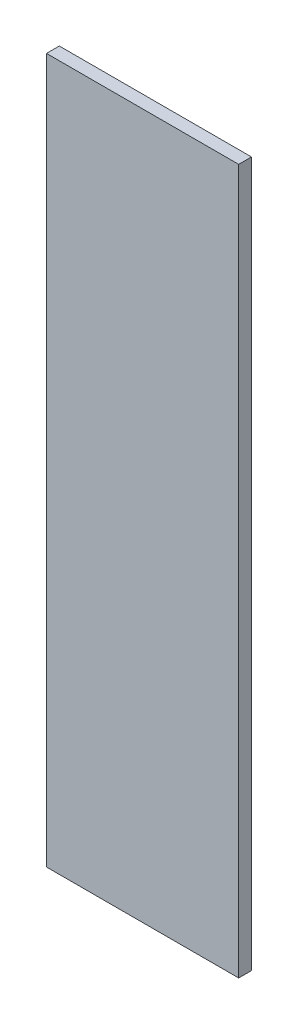
ISO-10303-21;
HEADER;
FILE_DESCRIPTION(('STEP AP214'),'2;1');
FILE_NAME('part.step','',(''),(''),'','','');
FILE_SCHEMA(('AUTOMOTIVE_DESIGN { 1 0 10303 214 1 1 1 1 }'));
ENDSEC;
DATA;
#1=APPLICATION_CONTEXT('core data for automotive mechanical design processes');
#2=APPLICATION_PROTOCOL_DEFINITION('international standard','automotive_design',2000,#1);
#3=PRODUCT_CONTEXT('',#1,'mechanical');
#4=PRODUCT('Part','Part','',(#3));
#5=PRODUCT_RELATED_PRODUCT_CATEGORY('part','',(#4));
#6=PRODUCT_DEFINITION_FORMATION('','',#4);
#7=PRODUCT_DEFINITION_CONTEXT('part definition',#1,'design');
#8=PRODUCT_DEFINITION('design','',#6,#7);
#9=PRODUCT_DEFINITION_SHAPE('','',#8);
#10=(LENGTH_UNIT() NAMED_UNIT(*) SI_UNIT(.MILLI.,.METRE.));
#11=(NAMED_UNIT(*) PLANE_ANGLE_UNIT() SI_UNIT($,.RADIAN.));
#12=(NAMED_UNIT(*) SI_UNIT($,.STERADIAN.) SOLID_ANGLE_UNIT());
#13=UNCERTAINTY_MEASURE_WITH_UNIT(LENGTH_MEASURE(1.E-05),#10,'distance_accuracy_value','');
#14=(GEOMETRIC_REPRESENTATION_CONTEXT(3) GLOBAL_UNCERTAINTY_ASSIGNED_CONTEXT((#13)) GLOBAL_UNIT_ASSIGNED_CONTEXT((#10,
#11,#12)) REPRESENTATION_CONTEXT('',''));
#15=CARTESIAN_POINT('',(0.,0.,0.));
#16=DIRECTION('',(0.,0.,1.));
#17=DIRECTION('',(1.,0.,0.));
#18=AXIS2_PLACEMENT_3D('',#15,#16,#17);
#19=CARTESIAN_POINT('',(-11.2355212355212,17.4324324324324,2.));
#20=DIRECTION('',(1.,0.,0.));
#21=DIRECTION('',(0.,1.,0.));
#22=AXIS2_PLACEMENT_3D('',#19,#20,#21);
#23=PLANE('',#22);
#24=DIRECTION('',(0.,-1.,0.));
#25=VECTOR('',#24,1.);
#26=CARTESIAN_POINT('',(-11.2355212355212,17.4324324324324,0.));
#27=LINE('',#26,#25);
#28=CARTESIAN_POINT('',(-11.2355212355212,17.4324324324324,0.));
#29=VERTEX_POINT('',#28);
#30=CARTESIAN_POINT('',(-11.2355212355212,-92.5675675675676,0.));
#31=VERTEX_POINT('',#30);
#32=EDGE_CURVE('E98',#29,#31,#27,.T.);
#33=ORIENTED_EDGE('',*,*,#32,.T.);
#34=DIRECTION('',(0.,0.,-1.));
#35=VECTOR('',#34,1.);
#36=CARTESIAN_POINT('',(-11.2355212355212,-92.5675675675676,2.));
#37=LINE('',#36,#35);
#38=CARTESIAN_POINT('',(-11.2355212355212,-92.5675675675676,2.));
#39=VERTEX_POINT('',#38);
#40=EDGE_CURVE('E11',#39,#31,#37,.T.);
#41=ORIENTED_EDGE('',*,*,#40,.F.);
#42=DIRECTION('',(0.,-1.,0.));
#43=VECTOR('',#42,1.);
#44=CARTESIAN_POINT('',(-11.2355212355212,17.4324324324324,2.));
#45=LINE('',#44,#43);
#46=CARTESIAN_POINT('',(-11.2355212355212,17.4324324324324,2.));
#47=VERTEX_POINT('',#46);
#48=EDGE_CURVE('E86',#47,#39,#45,.T.);
#49=ORIENTED_EDGE('',*,*,#48,.F.);
#50=DIRECTION('',(0.,0.,-1.));
#51=VECTOR('',#50,1.);
#52=CARTESIAN_POINT('',(-11.2355212355212,17.4324324324324,2.));
#53=LINE('',#52,#51);
#54=EDGE_CURVE('E94',#47,#29,#53,.T.);
#55=ORIENTED_EDGE('',*,*,#54,.T.);
#56=EDGE_LOOP('',(#33,#41,#49,#55));
#57=FACE_BOUND('',#56,.T.);
#58=ADVANCED_FACE('F35',(#57),#23,.F.);
#59=CARTESIAN_POINT('',(-11.2355212355212,-92.5675675675676,2.));
#60=DIRECTION('',(0.,1.,0.));
#61=DIRECTION('',(0.,0.,1.));
#62=AXIS2_PLACEMENT_3D('',#59,#60,#61);
#63=PLANE('',#62);
#64=DIRECTION('',(1.,0.,0.));
#65=VECTOR('',#64,1.);
#66=CARTESIAN_POINT('',(-11.2355212355212,-92.5675675675676,0.));
#67=LINE('',#66,#65);
#68=CARTESIAN_POINT('',(18.7644787644788,-92.5675675675676,0.));
#69=VERTEX_POINT('',#68);
#70=EDGE_CURVE('E90',#31,#69,#67,.T.);
#71=ORIENTED_EDGE('',*,*,#70,.T.);
#72=DIRECTION('',(0.,0.,-1.));
#73=VECTOR('',#72,1.);
#74=CARTESIAN_POINT('',(18.7644787644788,-92.5675675675676,2.));
#75=LINE('',#74,#73);
#76=CARTESIAN_POINT('',(18.7644787644788,-92.5675675675676,2.));
#77=VERTEX_POINT('',#76);
#78=EDGE_CURVE('E43',#77,#69,#75,.T.);
#79=ORIENTED_EDGE('',*,*,#78,.F.);
#80=DIRECTION('',(1.,0.,0.));
#81=VECTOR('',#80,1.);
#82=CARTESIAN_POINT('',(-11.2355212355212,-92.5675675675676,2.));
#83=LINE('',#82,#81);
#84=EDGE_CURVE('E81',#39,#77,#83,.T.);
#85=ORIENTED_EDGE('',*,*,#84,.F.);
#86=ORIENTED_EDGE('',*,*,#40,.T.);
#87=EDGE_LOOP('',(#71,#79,#85,#86));
#88=FACE_BOUND('',#87,.T.);
#89=ADVANCED_FACE('F89',(#88),#63,.F.);
#90=CARTESIAN_POINT('',(18.7644787644788,17.4324324324324,2.));
#91=DIRECTION('',(-1.,0.,0.));
#92=DIRECTION('',(0.,-1.,0.));
#93=AXIS2_PLACEMENT_3D('',#90,#91,#92);
#94=PLANE('',#93);
#95=DIRECTION('',(0.,1.,0.));
#96=VECTOR('',#95,1.);
#97=CARTESIAN_POINT('',(18.7644787644788,17.4324324324324,0.));
#98=LINE('',#97,#96);
#99=CARTESIAN_POINT('',(18.7644787644788,17.4324324324324,0.));
#100=VERTEX_POINT('',#99);
#101=EDGE_CURVE('E68',#69,#100,#98,.T.);
#102=ORIENTED_EDGE('',*,*,#101,.T.);
#103=DIRECTION('',(0.,0.,-1.));
#104=VECTOR('',#103,1.);
#105=CARTESIAN_POINT('',(18.7644787644788,17.4324324324324,2.));
#106=LINE('',#105,#104);
#107=CARTESIAN_POINT('',(18.7644787644788,17.4324324324324,2.));
#108=VERTEX_POINT('',#107);
#109=EDGE_CURVE('E91',#108,#100,#106,.T.);
#110=ORIENTED_EDGE('',*,*,#109,.F.);
#111=DIRECTION('',(0.,1.,0.));
#112=VECTOR('',#111,1.);
#113=CARTESIAN_POINT('',(18.7644787644788,17.4324324324324,2.));
#114=LINE('',#113,#112);
#115=EDGE_CURVE('E84',#77,#108,#114,.T.);
#116=ORIENTED_EDGE('',*,*,#115,.F.);
#117=ORIENTED_EDGE('',*,*,#78,.T.);
#118=EDGE_LOOP('',(#102,#110,#116,#117));
#119=FACE_BOUND('',#118,.T.);
#120=ADVANCED_FACE('F92',(#119),#94,.F.);
#121=CARTESIAN_POINT('',(-11.2355212355212,17.4324324324324,2.));
#122=DIRECTION('',(0.,-1.,0.));
#123=DIRECTION('',(0.,0.,-1.));
#124=AXIS2_PLACEMENT_3D('',#121,#122,#123);
#125=PLANE('',#124);
#126=DIRECTION('',(-1.,0.,0.));
#127=VECTOR('',#126,1.);
#128=CARTESIAN_POINT('',(-11.2355212355212,17.4324324324324,0.));
#129=LINE('',#128,#127);
#130=EDGE_CURVE('E74',#100,#29,#129,.T.);
#131=ORIENTED_EDGE('',*,*,#130,.T.);
#132=ORIENTED_EDGE('',*,*,#54,.F.);
#133=DIRECTION('',(-1.,0.,0.));
#134=VECTOR('',#133,1.);
#135=CARTESIAN_POINT('',(-11.2355212355212,17.4324324324324,2.));
#136=LINE('',#135,#134);
#137=EDGE_CURVE('E51',#108,#47,#136,.T.);
#138=ORIENTED_EDGE('',*,*,#137,.F.);
#139=ORIENTED_EDGE('',*,*,#109,.T.);
#140=EDGE_LOOP('',(#131,#132,#138,#139));
#141=FACE_BOUND('',#140,.T.);
#142=ADVANCED_FACE('F105',(#141),#125,.F.);
#143=CARTESIAN_POINT('',(0.,0.,2.));
#144=DIRECTION('',(0.,0.,1.));
#145=DIRECTION('',(1.,0.,0.));
#146=AXIS2_PLACEMENT_3D('',#143,#144,#145);
#147=PLANE('',#146);
#148=ORIENTED_EDGE('',*,*,#48,.T.);
#149=ORIENTED_EDGE('',*,*,#84,.T.);
#150=ORIENTED_EDGE('',*,*,#115,.T.);
#151=ORIENTED_EDGE('',*,*,#137,.T.);
#152=EDGE_LOOP('',(#148,#149,#150,#151));
#153=FACE_BOUND('',#152,.T.);
#154=ADVANCED_FACE('F82',(#153),#147,.T.);
#155=CARTESIAN_POINT('',(0.,0.,0.));
#156=DIRECTION('',(0.,0.,1.));
#157=DIRECTION('',(1.,0.,0.));
#158=AXIS2_PLACEMENT_3D('',#155,#156,#157);
#159=PLANE('',#158);
#160=ORIENTED_EDGE('',*,*,#32,.F.);
#161=ORIENTED_EDGE('',*,*,#130,.F.);
#162=ORIENTED_EDGE('',*,*,#101,.F.);
#163=ORIENTED_EDGE('',*,*,#70,.F.);
#164=EDGE_LOOP('',(#160,#161,#162,#163));
#165=FACE_BOUND('',#164,.T.);
#166=ADVANCED_FACE('F108',(#165),#159,.F.);
#167=CLOSED_SHELL('',(#58,#89,#120,#142,#154,#166));
#168=MANIFOLD_SOLID_BREP('B2',#167);
#169=ADVANCED_BREP_SHAPE_REPRESENTATION('',(#18,#168),#14);
#170=SHAPE_DEFINITION_REPRESENTATION(#9,#169);
ENDSEC;
END-ISO-10303-21;
